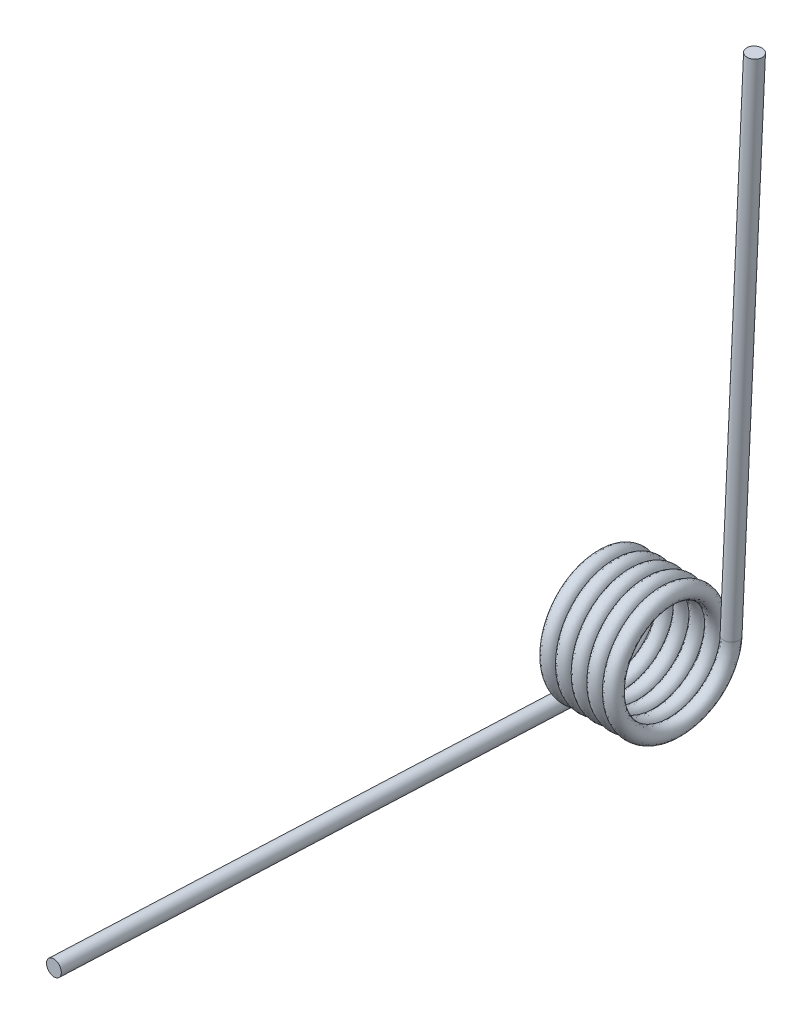
ISO-10303-21;
HEADER;
FILE_DESCRIPTION(('STEP AP214'),'2;1');
FILE_NAME('part.step','',(''),(''),'','','');
FILE_SCHEMA(('AUTOMOTIVE_DESIGN { 1 0 10303 214 1 1 1 1 }'));
ENDSEC;
DATA;
#1=APPLICATION_CONTEXT('core data for automotive mechanical design processes');
#2=APPLICATION_PROTOCOL_DEFINITION('international standard','automotive_design',2000,#1);
#3=PRODUCT_CONTEXT('',#1,'mechanical');
#4=PRODUCT('Part','Part','',(#3));
#5=PRODUCT_RELATED_PRODUCT_CATEGORY('part','',(#4));
#6=PRODUCT_DEFINITION_FORMATION('','',#4);
#7=PRODUCT_DEFINITION_CONTEXT('part definition',#1,'design');
#8=PRODUCT_DEFINITION('design','',#6,#7);
#9=PRODUCT_DEFINITION_SHAPE('','',#8);
#10=(LENGTH_UNIT() NAMED_UNIT(*) SI_UNIT(.MILLI.,.METRE.));
#11=(NAMED_UNIT(*) PLANE_ANGLE_UNIT() SI_UNIT($,.RADIAN.));
#12=(NAMED_UNIT(*) SI_UNIT($,.STERADIAN.) SOLID_ANGLE_UNIT());
#13=UNCERTAINTY_MEASURE_WITH_UNIT(LENGTH_MEASURE(1.E-05),#10,'distance_accuracy_value','');
#14=(GEOMETRIC_REPRESENTATION_CONTEXT(3) GLOBAL_UNCERTAINTY_ASSIGNED_CONTEXT((#13)) GLOBAL_UNIT_ASSIGNED_CONTEXT((#10,
#11,#12)) REPRESENTATION_CONTEXT('',''));
#15=CARTESIAN_POINT('',(0.,0.,0.));
#16=DIRECTION('',(0.,0.,1.));
#17=DIRECTION('',(1.,0.,0.));
#18=AXIS2_PLACEMENT_3D('',#15,#16,#17);
#19=CARTESIAN_POINT('',(-1.33212713981838,-9.43610000000001,-0.0604940770597761));
#20=CARTESIAN_POINT('',(-1.10776047315171,-9.40117372832516,-5.50842895216001));
#21=CARTESIAN_POINT('',(-0.883393806485048,-4.66566059248774,-8.20214935118023));
#22=CARTESIAN_POINT('',(-0.659027139818381,0.0698525433496787,-10.8958697502005));
#23=CARTESIAN_POINT('',(-0.434660473151715,4.77043940751226,-8.14165527412046));
#24=CARTESIAN_POINT('',(-0.210293806485049,9.47102627167484,-5.38744079804046));
#25=CARTESIAN_POINT('',(0.0140728601816173,9.43610000000001,0.0604940770597749));
#26=CARTESIAN_POINT('',(0.238439526848283,9.40117372832517,5.50842895216));
#27=CARTESIAN_POINT('',(0.46280619351495,4.66566059248775,8.20214935118023));
#28=CARTESIAN_POINT('',(0.687172860181616,-0.0698525433496773,10.8958697502005));
#29=CARTESIAN_POINT('',(0.911539526848282,-4.77043940751226,8.14165527412046));
#30=CARTESIAN_POINT('',(1.13590619351495,-9.47102627167484,5.38744079804046));
#31=CARTESIAN_POINT('',(1.36027286018161,-9.43610000000001,-0.0604940770597761));
#32=CARTESIAN_POINT('',(1.58463952684828,-9.40117372832516,-5.50842895216001));
#33=CARTESIAN_POINT('',(1.80900619351495,-4.66566059248774,-8.20214935118023));
#34=CARTESIAN_POINT('',(2.03337286018161,0.0698525433496787,-10.8958697502005));
#35=CARTESIAN_POINT('',(2.25773952684828,4.77043940751226,-8.14165527412046));
#36=CARTESIAN_POINT('',(2.48210619351495,9.47102627167484,-5.38744079804046));
#37=CARTESIAN_POINT('',(2.70647286018161,9.43610000000001,0.0604940770597749));
#38=CARTESIAN_POINT('',(2.93083952684828,9.40117372832517,5.50842895216));
#39=CARTESIAN_POINT('',(3.15520619351494,4.66566059248775,8.20214935118023));
#40=CARTESIAN_POINT('',(3.37957286018161,-0.0698525433496773,10.8958697502005));
#41=CARTESIAN_POINT('',(3.60393952684828,-4.77043940751226,8.14165527412046));
#42=CARTESIAN_POINT('',(3.82830619351494,-9.47102627167484,5.38744079804046));
#43=CARTESIAN_POINT('',(4.05267286018161,-9.43610000000001,-0.0604940770597761));
#44=CARTESIAN_POINT('',(4.27703952684827,-9.40117372832516,-5.50842895216001));
#45=CARTESIAN_POINT('',(4.50140619351494,-4.66566059248774,-8.20214935118023));
#46=CARTESIAN_POINT('',(4.72577286018161,0.0698525433496787,-10.8958697502005));
#47=CARTESIAN_POINT('',(4.95013952684827,4.77043940751226,-8.14165527412046));
#48=CARTESIAN_POINT('',(5.17450619351494,9.47102627167484,-5.38744079804046));
#49=CARTESIAN_POINT('',(5.39887286018161,9.43610000000001,0.0604940770597749));
#50=CARTESIAN_POINT('',(5.62323952684827,9.40117372832517,5.50842895216));
#51=CARTESIAN_POINT('',(5.84760619351494,4.66566059248775,8.20214935118023));
#52=CARTESIAN_POINT('',(6.0719728601816,-0.0698525433496773,10.8958697502005));
#53=CARTESIAN_POINT('',(6.29633952684827,-4.77043940751226,8.14165527412046));
#54=CARTESIAN_POINT('',(6.52070619351494,-9.47102627167484,5.38744079804046));
#55=CARTESIAN_POINT('',(6.7450728601816,-9.43610000000001,-0.0604940770597761));
#56=CARTESIAN_POINT('',(6.96943952684827,-9.40117372832516,-5.50842895216001));
#57=CARTESIAN_POINT('',(7.19380619351493,-4.66566059248774,-8.20214935118023));
#58=CARTESIAN_POINT('',(7.4181728601816,0.0698525433496787,-10.8958697502005));
#59=CARTESIAN_POINT('',(7.64253952684827,4.77043940751226,-8.14165527412046));
#60=CARTESIAN_POINT('',(7.86690619351493,9.47102627167484,-5.38744079804046));
#61=CARTESIAN_POINT('',(8.0912728601816,9.43610000000001,0.0604940770597749));
#62=CARTESIAN_POINT('',(8.31563952684827,9.40117372832517,5.50842895216));
#63=CARTESIAN_POINT('',(8.54000619351493,4.66566059248775,8.20214935118023));
#64=CARTESIAN_POINT('',(8.7643728601816,-0.0698525433496773,10.8958697502005));
#65=CARTESIAN_POINT('',(8.98873952684826,-4.77043940751226,8.14165527412046));
#66=CARTESIAN_POINT('',(9.21310619351493,-9.47102627167484,5.38744079804046));
#67=CARTESIAN_POINT('',(9.4374728601816,-9.43610000000001,-0.0604940770597761));
#68=CARTESIAN_POINT('',(9.66183952684827,-9.40117372832516,-5.50842895216001));
#69=CARTESIAN_POINT('',(9.88620619351493,-4.66566059248774,-8.20214935118023));
#70=CARTESIAN_POINT('',(10.1105728601816,0.0698525433496787,-10.8958697502005));
#71=CARTESIAN_POINT('',(10.3349395268483,4.77043940751226,-8.14165527412046));
#72=CARTESIAN_POINT('',(10.5593061935149,9.47102627167484,-5.38744079804046));
#73=CARTESIAN_POINT('',(10.7836728601816,9.43610000000001,0.0604940770597749));
#74=CARTESIAN_POINT('',(11.0080395268483,9.40117372832517,5.50842895216));
#75=CARTESIAN_POINT('',(11.2324061935149,4.66566059248775,8.20214935118023));
#76=CARTESIAN_POINT('',(11.4567728601816,-0.0698525433496773,10.8958697502005));
#77=CARTESIAN_POINT('',(11.6811395268483,-4.77043940751226,8.14165527412046));
#78=CARTESIAN_POINT('',(11.9055061935149,-9.47102627167484,5.38744079804046));
#79=CARTESIAN_POINT('',(12.1298728601816,-9.43610000000001,-0.0604940770597761));
#80=CARTESIAN_POINT('',(12.3542395268483,-9.40117372832516,-5.50842895216001));
#81=CARTESIAN_POINT('',(12.5786061935149,-4.66566059248774,-8.20214935118023));
#82=CARTESIAN_POINT('',(12.8029728601816,0.0698525433496787,-10.8958697502005));
#83=CARTESIAN_POINT('',(13.0273395268483,4.77043940751226,-8.14165527412046));
#84=CARTESIAN_POINT('',(13.2517061935149,9.47102627167484,-5.38744079804046));
#85=CARTESIAN_POINT('',(13.4760728601816,9.43610000000001,0.0604940770597749));
#86=CARTESIAN_POINT('',(13.7004395268483,9.40117372832517,5.50842895216));
#87=CARTESIAN_POINT('',(13.9248061935149,4.66566059248775,8.20214935118023));
#88=CARTESIAN_POINT('',(14.1491728601816,-0.0698525433496773,10.8958697502005));
#89=CARTESIAN_POINT('',(14.3735395268483,-4.77043940751226,8.14165527412046));
#90=CARTESIAN_POINT('',(14.5979061935149,-9.47102627167484,5.38744079804046));
#91=CARTESIAN_POINT('',(14.8222728601816,-9.43610000000001,-0.0604940770597761));
#92=CARTESIAN_POINT('',(-1.33212713981838,-6.76910000000001,-0.060494077059746));
#93=CARTESIAN_POINT('',(-1.10776047315171,-6.73417372832518,-3.96863578423124));
#94=CARTESIAN_POINT('',(-0.883393806485049,-3.33216059248777,-5.89245959928712));
#95=CARTESIAN_POINT('',(-0.659027139818383,0.0698525433496441,-7.816283414343));
#96=CARTESIAN_POINT('',(-0.434660473151716,3.43693940751224,-5.83196552222738));
#97=CARTESIAN_POINT('',(-0.21029380648505,6.80402627167483,-3.84764763011176));
#98=CARTESIAN_POINT('',(0.014072860181616,6.76910000000001,0.0604940770597451));
#99=CARTESIAN_POINT('',(0.238439526848282,6.73417372832518,3.96863578423124));
#100=CARTESIAN_POINT('',(0.462806193514948,3.33216059248777,5.89245959928712));
#101=CARTESIAN_POINT('',(0.687172860181614,-0.0698525433496432,7.816283414343));
#102=CARTESIAN_POINT('',(0.911539526848281,-3.43693940751223,5.83196552222738));
#103=CARTESIAN_POINT('',(1.13590619351495,-6.80402627167483,3.84764763011176));
#104=CARTESIAN_POINT('',(1.36027286018161,-6.76910000000001,-0.060494077059746));
#105=CARTESIAN_POINT('',(1.58463952684828,-6.73417372832518,-3.96863578423124));
#106=CARTESIAN_POINT('',(1.80900619351495,-3.33216059248777,-5.89245959928712));
#107=CARTESIAN_POINT('',(2.03337286018161,0.0698525433496441,-7.816283414343));
#108=CARTESIAN_POINT('',(2.25773952684828,3.43693940751224,-5.83196552222738));
#109=CARTESIAN_POINT('',(2.48210619351494,6.80402627167483,-3.84764763011176));
#110=CARTESIAN_POINT('',(2.70647286018161,6.76910000000001,0.0604940770597451));
#111=CARTESIAN_POINT('',(2.93083952684828,6.73417372832518,3.96863578423124));
#112=CARTESIAN_POINT('',(3.15520619351494,3.33216059248777,5.89245959928712));
#113=CARTESIAN_POINT('',(3.37957286018161,-0.0698525433496432,7.816283414343));
#114=CARTESIAN_POINT('',(3.60393952684827,-3.43693940751223,5.83196552222738));
#115=CARTESIAN_POINT('',(3.82830619351494,-6.80402627167483,3.84764763011176));
#116=CARTESIAN_POINT('',(4.05267286018161,-6.76910000000001,-0.060494077059746));
#117=CARTESIAN_POINT('',(4.27703952684827,-6.73417372832518,-3.96863578423124));
#118=CARTESIAN_POINT('',(4.50140619351494,-3.33216059248777,-5.89245959928712));
#119=CARTESIAN_POINT('',(4.72577286018161,0.0698525433496441,-7.816283414343));
#120=CARTESIAN_POINT('',(4.95013952684827,3.43693940751224,-5.83196552222738));
#121=CARTESIAN_POINT('',(5.17450619351494,6.80402627167483,-3.84764763011176));
#122=CARTESIAN_POINT('',(5.3988728601816,6.76910000000001,0.0604940770597451));
#123=CARTESIAN_POINT('',(5.62323952684827,6.73417372832518,3.96863578423124));
#124=CARTESIAN_POINT('',(5.84760619351494,3.33216059248777,5.89245959928712));
#125=CARTESIAN_POINT('',(6.0719728601816,-0.0698525433496432,7.816283414343));
#126=CARTESIAN_POINT('',(6.29633952684827,-3.43693940751223,5.83196552222738));
#127=CARTESIAN_POINT('',(6.52070619351494,-6.80402627167483,3.84764763011176));
#128=CARTESIAN_POINT('',(6.7450728601816,-6.76910000000001,-0.060494077059746));
#129=CARTESIAN_POINT('',(6.96943952684827,-6.73417372832518,-3.96863578423124));
#130=CARTESIAN_POINT('',(7.19380619351493,-3.33216059248777,-5.89245959928712));
#131=CARTESIAN_POINT('',(7.4181728601816,0.0698525433496441,-7.816283414343));
#132=CARTESIAN_POINT('',(7.64253952684826,3.43693940751224,-5.83196552222738));
#133=CARTESIAN_POINT('',(7.86690619351493,6.80402627167483,-3.84764763011176));
#134=CARTESIAN_POINT('',(8.0912728601816,6.76910000000001,0.0604940770597451));
#135=CARTESIAN_POINT('',(8.31563952684826,6.73417372832518,3.96863578423124));
#136=CARTESIAN_POINT('',(8.54000619351493,3.33216059248777,5.89245959928712));
#137=CARTESIAN_POINT('',(8.7643728601816,-0.0698525433496432,7.816283414343));
#138=CARTESIAN_POINT('',(8.98873952684826,-3.43693940751223,5.83196552222738));
#139=CARTESIAN_POINT('',(9.21310619351493,-6.80402627167483,3.84764763011176));
#140=CARTESIAN_POINT('',(9.43747286018159,-6.76910000000001,-0.060494077059746));
#141=CARTESIAN_POINT('',(9.66183952684826,-6.73417372832518,-3.96863578423124));
#142=CARTESIAN_POINT('',(9.88620619351493,-3.33216059248777,-5.89245959928712));
#143=CARTESIAN_POINT('',(10.1105728601816,0.0698525433496441,-7.816283414343));
#144=CARTESIAN_POINT('',(10.3349395268483,3.43693940751224,-5.83196552222738));
#145=CARTESIAN_POINT('',(10.5593061935149,6.80402627167483,-3.84764763011176));
#146=CARTESIAN_POINT('',(10.7836728601816,6.76910000000001,0.0604940770597451));
#147=CARTESIAN_POINT('',(11.0080395268483,6.73417372832518,3.96863578423124));
#148=CARTESIAN_POINT('',(11.2324061935149,3.33216059248777,5.89245959928712));
#149=CARTESIAN_POINT('',(11.4567728601816,-0.0698525433496432,7.816283414343));
#150=CARTESIAN_POINT('',(11.6811395268483,-3.43693940751223,5.83196552222738));
#151=CARTESIAN_POINT('',(11.9055061935149,-6.80402627167483,3.84764763011176));
#152=CARTESIAN_POINT('',(12.1298728601816,-6.76910000000001,-0.060494077059746));
#153=CARTESIAN_POINT('',(12.3542395268483,-6.73417372832518,-3.96863578423124));
#154=CARTESIAN_POINT('',(12.5786061935149,-3.33216059248777,-5.89245959928712));
#155=CARTESIAN_POINT('',(12.8029728601816,0.0698525433496441,-7.816283414343));
#156=CARTESIAN_POINT('',(13.0273395268483,3.43693940751224,-5.83196552222738));
#157=CARTESIAN_POINT('',(13.2517061935149,6.80402627167483,-3.84764763011176));
#158=CARTESIAN_POINT('',(13.4760728601816,6.76910000000001,0.0604940770597451));
#159=CARTESIAN_POINT('',(13.7004395268483,6.73417372832518,3.96863578423124));
#160=CARTESIAN_POINT('',(13.9248061935149,3.33216059248777,5.89245959928712));
#161=CARTESIAN_POINT('',(14.1491728601816,-0.0698525433496432,7.816283414343));
#162=CARTESIAN_POINT('',(14.3735395268483,-3.43693940751223,5.83196552222738));
#163=CARTESIAN_POINT('',(14.5979061935149,-6.80402627167483,3.84764763011176));
#164=CARTESIAN_POINT('',(14.8222728601816,-6.76910000000001,-0.060494077059746));
#165=CARTESIAN_POINT('',(1.33212713981838,-6.76910000000001,0.0604940770596085));
#166=CARTESIAN_POINT('',(1.55649380648504,-6.80402627167475,-3.84764763011189));
#167=CARTESIAN_POINT('',(1.78086047315171,-3.43693940751212,-5.83196552222744));
#168=CARTESIAN_POINT('',(2.00522713981838,-0.0698525433494863,-7.816283414343));
#169=CARTESIAN_POINT('',(2.22959380648504,3.33216059248789,-5.89245959928705));
#170=CARTESIAN_POINT('',(2.45396047315171,6.73417372832526,-3.96863578423111));
#171=CARTESIAN_POINT('',(2.67832713981838,6.76910000000001,-0.0604940770596093));
#172=CARTESIAN_POINT('',(2.90269380648504,6.80402627167475,3.84764763011189));
#173=CARTESIAN_POINT('',(3.12706047315171,3.43693940751212,5.83196552222744));
#174=CARTESIAN_POINT('',(3.35142713981837,0.0698525433494872,7.816283414343));
#175=CARTESIAN_POINT('',(3.57579380648504,-3.33216059248788,5.89245959928706));
#176=CARTESIAN_POINT('',(3.80016047315171,-6.73417372832526,3.96863578423111));
#177=CARTESIAN_POINT('',(4.02452713981837,-6.76910000000001,0.0604940770596085));
#178=CARTESIAN_POINT('',(4.24889380648504,-6.80402627167475,-3.84764763011189));
#179=CARTESIAN_POINT('',(4.4732604731517,-3.43693940751212,-5.83196552222744));
#180=CARTESIAN_POINT('',(4.69762713981837,-0.0698525433494863,-7.816283414343));
#181=CARTESIAN_POINT('',(4.92199380648504,3.33216059248789,-5.89245959928705));
#182=CARTESIAN_POINT('',(5.1463604731517,6.73417372832526,-3.96863578423111));
#183=CARTESIAN_POINT('',(5.37072713981837,6.76910000000001,-0.0604940770596093));
#184=CARTESIAN_POINT('',(5.59509380648503,6.80402627167475,3.84764763011189));
#185=CARTESIAN_POINT('',(5.8194604731517,3.43693940751212,5.83196552222744));
#186=CARTESIAN_POINT('',(6.04382713981837,0.0698525433494872,7.816283414343));
#187=CARTESIAN_POINT('',(6.26819380648503,-3.33216059248788,5.89245959928706));
#188=CARTESIAN_POINT('',(6.4925604731517,-6.73417372832526,3.96863578423111));
#189=CARTESIAN_POINT('',(6.71692713981837,-6.76910000000001,0.0604940770596085));
#190=CARTESIAN_POINT('',(6.94129380648503,-6.80402627167475,-3.84764763011189));
#191=CARTESIAN_POINT('',(7.1656604731517,-3.43693940751212,-5.83196552222744));
#192=CARTESIAN_POINT('',(7.39002713981836,-0.0698525433494863,-7.816283414343));
#193=CARTESIAN_POINT('',(7.61439380648503,3.33216059248789,-5.89245959928705));
#194=CARTESIAN_POINT('',(7.8387604731517,6.73417372832526,-3.96863578423111));
#195=CARTESIAN_POINT('',(8.06312713981836,6.76910000000001,-0.0604940770596093));
#196=CARTESIAN_POINT('',(8.28749380648503,6.80402627167475,3.84764763011189));
#197=CARTESIAN_POINT('',(8.51186047315169,3.43693940751212,5.83196552222744));
#198=CARTESIAN_POINT('',(8.73622713981836,0.0698525433494872,7.816283414343));
#199=CARTESIAN_POINT('',(8.96059380648503,-3.33216059248788,5.89245959928706));
#200=CARTESIAN_POINT('',(9.18496047315169,-6.73417372832526,3.96863578423111));
#201=CARTESIAN_POINT('',(9.40932713981836,-6.76910000000001,0.0604940770596085));
#202=CARTESIAN_POINT('',(9.63369380648503,-6.80402627167475,-3.84764763011189));
#203=CARTESIAN_POINT('',(9.85806047315169,-3.43693940751212,-5.83196552222744));
#204=CARTESIAN_POINT('',(10.0824271398184,-0.0698525433494863,-7.816283414343));
#205=CARTESIAN_POINT('',(10.306793806485,3.33216059248789,-5.89245959928705));
#206=CARTESIAN_POINT('',(10.5311604731517,6.73417372832526,-3.96863578423111));
#207=CARTESIAN_POINT('',(10.7555271398184,6.76910000000001,-0.0604940770596093));
#208=CARTESIAN_POINT('',(10.979893806485,6.80402627167475,3.84764763011189));
#209=CARTESIAN_POINT('',(11.2042604731517,3.43693940751212,5.83196552222744));
#210=CARTESIAN_POINT('',(11.4286271398184,0.0698525433494872,7.816283414343));
#211=CARTESIAN_POINT('',(11.652993806485,-3.33216059248788,5.89245959928706));
#212=CARTESIAN_POINT('',(11.8773604731517,-6.73417372832526,3.96863578423111));
#213=CARTESIAN_POINT('',(12.1017271398184,-6.76910000000001,0.0604940770596085));
#214=CARTESIAN_POINT('',(12.326093806485,-6.80402627167475,-3.84764763011189));
#215=CARTESIAN_POINT('',(12.5504604731517,-3.43693940751212,-5.83196552222744));
#216=CARTESIAN_POINT('',(12.7748271398184,-0.0698525433494863,-7.816283414343));
#217=CARTESIAN_POINT('',(12.999193806485,3.33216059248789,-5.89245959928705));
#218=CARTESIAN_POINT('',(13.2235604731517,6.73417372832526,-3.96863578423111));
#219=CARTESIAN_POINT('',(13.4479271398184,6.76910000000001,-0.0604940770596093));
#220=CARTESIAN_POINT('',(13.672293806485,6.80402627167475,3.84764763011189));
#221=CARTESIAN_POINT('',(13.8966604731517,3.43693940751212,5.83196552222744));
#222=CARTESIAN_POINT('',(14.1210271398184,0.0698525433494872,7.816283414343));
#223=CARTESIAN_POINT('',(14.345393806485,-3.33216059248788,5.89245959928706));
#224=CARTESIAN_POINT('',(14.5697604731517,-6.73417372832526,3.96863578423111));
#225=CARTESIAN_POINT('',(14.7941271398184,-6.76910000000001,0.0604940770596085));
#226=CARTESIAN_POINT('',(15.018493806485,-6.80402627167475,-3.84764763011189));
#227=CARTESIAN_POINT('',(15.2428604731517,-3.43693940751212,-5.83196552222744));
#228=CARTESIAN_POINT('',(15.4672271398183,-0.0698525433494863,-7.816283414343));
#229=CARTESIAN_POINT('',(15.691593806485,3.33216059248789,-5.89245959928705));
#230=CARTESIAN_POINT('',(15.9159604731517,6.73417372832526,-3.96863578423111));
#231=CARTESIAN_POINT('',(16.1403271398183,6.76910000000001,-0.0604940770596093));
#232=CARTESIAN_POINT('',(16.364693806485,6.80402627167475,3.84764763011189));
#233=CARTESIAN_POINT('',(16.5890604731517,3.43693940751212,5.83196552222744));
#234=CARTESIAN_POINT('',(16.8134271398183,0.0698525433494872,7.816283414343));
#235=CARTESIAN_POINT('',(17.037793806485,-3.33216059248788,5.89245959928706));
#236=CARTESIAN_POINT('',(17.2621604731517,-6.73417372832526,3.96863578423111));
#237=CARTESIAN_POINT('',(17.4865271398183,-6.76910000000001,0.0604940770596085));
#238=CARTESIAN_POINT('',(1.33212713981838,-9.43610000000001,0.0604940770595784));
#239=CARTESIAN_POINT('',(1.55649380648505,-9.47102627167473,-5.38744079804065));
#240=CARTESIAN_POINT('',(1.78086047315171,-4.77043940751209,-8.14165527412056));
#241=CARTESIAN_POINT('',(2.00522713981838,-0.0698525433494517,-10.8958697502005));
#242=CARTESIAN_POINT('',(2.22959380648504,4.66566059248791,-8.20214935118014));
#243=CARTESIAN_POINT('',(2.45396047315171,9.40117372832528,-5.50842895215981));
#244=CARTESIAN_POINT('',(2.67832713981838,9.43610000000001,-0.0604940770595795));
#245=CARTESIAN_POINT('',(2.90269380648504,9.47102627167473,5.38744079804065));
#246=CARTESIAN_POINT('',(3.12706047315171,4.77043940751209,8.14165527412055));
#247=CARTESIAN_POINT('',(3.35142713981838,0.0698525433494531,10.8958697502005));
#248=CARTESIAN_POINT('',(3.57579380648504,-4.66566059248791,8.20214935118014));
#249=CARTESIAN_POINT('',(3.80016047315171,-9.40117372832528,5.50842895215981));
#250=CARTESIAN_POINT('',(4.02452713981837,-9.43610000000001,0.0604940770595784));
#251=CARTESIAN_POINT('',(4.24889380648504,-9.47102627167473,-5.38744079804065));
#252=CARTESIAN_POINT('',(4.47326047315171,-4.77043940751209,-8.14165527412056));
#253=CARTESIAN_POINT('',(4.69762713981837,-0.0698525433494517,-10.8958697502005));
#254=CARTESIAN_POINT('',(4.92199380648504,4.66566059248791,-8.20214935118014));
#255=CARTESIAN_POINT('',(5.1463604731517,9.40117372832528,-5.50842895215981));
#256=CARTESIAN_POINT('',(5.37072713981837,9.43610000000001,-0.0604940770595795));
#257=CARTESIAN_POINT('',(5.59509380648504,9.47102627167473,5.38744079804065));
#258=CARTESIAN_POINT('',(5.8194604731517,4.77043940751209,8.14165527412055));
#259=CARTESIAN_POINT('',(6.04382713981837,0.0698525433494531,10.8958697502005));
#260=CARTESIAN_POINT('',(6.26819380648504,-4.66566059248791,8.20214935118014));
#261=CARTESIAN_POINT('',(6.4925604731517,-9.40117372832528,5.50842895215981));
#262=CARTESIAN_POINT('',(6.71692713981837,-9.43610000000001,0.0604940770595784));
#263=CARTESIAN_POINT('',(6.94129380648503,-9.47102627167473,-5.38744079804065));
#264=CARTESIAN_POINT('',(7.1656604731517,-4.77043940751209,-8.14165527412056));
#265=CARTESIAN_POINT('',(7.39002713981837,-0.0698525433494517,-10.8958697502005));
#266=CARTESIAN_POINT('',(7.61439380648503,4.66566059248791,-8.20214935118014));
#267=CARTESIAN_POINT('',(7.8387604731517,9.40117372832528,-5.50842895215981));
#268=CARTESIAN_POINT('',(8.06312713981836,9.43610000000001,-0.0604940770595795));
#269=CARTESIAN_POINT('',(8.28749380648503,9.47102627167473,5.38744079804065));
#270=CARTESIAN_POINT('',(8.5118604731517,4.77043940751209,8.14165527412055));
#271=CARTESIAN_POINT('',(8.73622713981836,0.0698525433494531,10.8958697502005));
#272=CARTESIAN_POINT('',(8.96059380648503,-4.66566059248791,8.20214935118014));
#273=CARTESIAN_POINT('',(9.1849604731517,-9.40117372832528,5.50842895215981));
#274=CARTESIAN_POINT('',(9.40932713981836,-9.43610000000001,0.0604940770595784));
#275=CARTESIAN_POINT('',(9.63369380648503,-9.47102627167473,-5.38744079804065));
#276=CARTESIAN_POINT('',(9.85806047315169,-4.77043940751209,-8.14165527412056));
#277=CARTESIAN_POINT('',(10.0824271398184,-0.0698525433494517,-10.8958697502005));
#278=CARTESIAN_POINT('',(10.306793806485,4.66566059248791,-8.20214935118014));
#279=CARTESIAN_POINT('',(10.5311604731517,9.40117372832528,-5.50842895215981));
#280=CARTESIAN_POINT('',(10.7555271398184,9.43610000000001,-0.0604940770595795));
#281=CARTESIAN_POINT('',(10.979893806485,9.47102627167473,5.38744079804065));
#282=CARTESIAN_POINT('',(11.2042604731517,4.77043940751209,8.14165527412055));
#283=CARTESIAN_POINT('',(11.4286271398184,0.0698525433494531,10.8958697502005));
#284=CARTESIAN_POINT('',(11.652993806485,-4.66566059248791,8.20214935118014));
#285=CARTESIAN_POINT('',(11.8773604731517,-9.40117372832528,5.50842895215981));
#286=CARTESIAN_POINT('',(12.1017271398184,-9.43610000000001,0.0604940770595784));
#287=CARTESIAN_POINT('',(12.326093806485,-9.47102627167473,-5.38744079804065));
#288=CARTESIAN_POINT('',(12.5504604731517,-4.77043940751209,-8.14165527412056));
#289=CARTESIAN_POINT('',(12.7748271398184,-0.0698525433494517,-10.8958697502005));
#290=CARTESIAN_POINT('',(12.999193806485,4.66566059248791,-8.20214935118014));
#291=CARTESIAN_POINT('',(13.2235604731517,9.40117372832528,-5.50842895215981));
#292=CARTESIAN_POINT('',(13.4479271398184,9.43610000000001,-0.0604940770595795));
#293=CARTESIAN_POINT('',(13.672293806485,9.47102627167473,5.38744079804065));
#294=CARTESIAN_POINT('',(13.8966604731517,4.77043940751209,8.14165527412055));
#295=CARTESIAN_POINT('',(14.1210271398184,0.0698525433494531,10.8958697502005));
#296=CARTESIAN_POINT('',(14.345393806485,-4.66566059248791,8.20214935118014));
#297=CARTESIAN_POINT('',(14.5697604731517,-9.40117372832528,5.50842895215981));
#298=CARTESIAN_POINT('',(14.7941271398184,-9.43610000000001,0.0604940770595784));
#299=CARTESIAN_POINT('',(15.018493806485,-9.47102627167473,-5.38744079804065));
#300=CARTESIAN_POINT('',(15.2428604731517,-4.77043940751209,-8.14165527412056));
#301=CARTESIAN_POINT('',(15.4672271398183,-0.0698525433494517,-10.8958697502005));
#302=CARTESIAN_POINT('',(15.691593806485,4.66566059248791,-8.20214935118014));
#303=CARTESIAN_POINT('',(15.9159604731517,9.40117372832528,-5.50842895215981));
#304=CARTESIAN_POINT('',(16.1403271398183,9.43610000000001,-0.0604940770595795));
#305=CARTESIAN_POINT('',(16.364693806485,9.47102627167473,5.38744079804065));
#306=CARTESIAN_POINT('',(16.5890604731517,4.77043940751209,8.14165527412055));
#307=CARTESIAN_POINT('',(16.8134271398183,0.0698525433494531,10.8958697502005));
#308=CARTESIAN_POINT('',(17.037793806485,-4.66566059248791,8.20214935118014));
#309=CARTESIAN_POINT('',(17.2621604731517,-9.40117372832528,5.50842895215981));
#310=CARTESIAN_POINT('',(17.4865271398183,-9.43610000000001,0.0604940770595784));
#311=CARTESIAN_POINT('',(1.33212713981838,-12.1031,0.0604940770595483));
#312=CARTESIAN_POINT('',(1.55649380648505,-12.1380262716747,-6.92723396596941));
#313=CARTESIAN_POINT('',(1.78086047315171,-6.10393940751207,-10.4513450260137));
#314=CARTESIAN_POINT('',(2.00522713981838,-0.0698525433494172,-13.9754560860579));
#315=CARTESIAN_POINT('',(2.22959380648505,5.99916059248794,-10.5118391030732));
#316=CARTESIAN_POINT('',(2.45396047315171,12.0681737283253,-7.04822212008851));
#317=CARTESIAN_POINT('',(2.67832713981838,12.1031,-0.0604940770595498));
#318=CARTESIAN_POINT('',(2.90269380648504,12.1380262716747,6.92723396596941));
#319=CARTESIAN_POINT('',(3.12706047315171,6.10393940751207,10.4513450260137));
#320=CARTESIAN_POINT('',(3.35142713981838,0.0698525433494189,13.9754560860579));
#321=CARTESIAN_POINT('',(3.57579380648504,-5.99916059248793,10.5118391030732));
#322=CARTESIAN_POINT('',(3.80016047315171,-12.0681737283253,7.04822212008852));
#323=CARTESIAN_POINT('',(4.02452713981838,-12.1031,0.0604940770595483));
#324=CARTESIAN_POINT('',(4.24889380648504,-12.1380262716747,-6.92723396596941));
#325=CARTESIAN_POINT('',(4.47326047315171,-6.10393940751207,-10.4513450260137));
#326=CARTESIAN_POINT('',(4.69762713981837,-0.0698525433494172,-13.9754560860579));
#327=CARTESIAN_POINT('',(4.92199380648504,5.99916059248794,-10.5118391030732));
#328=CARTESIAN_POINT('',(5.14636047315171,12.0681737283253,-7.04822212008851));
#329=CARTESIAN_POINT('',(5.37072713981837,12.1031,-0.0604940770595498));
#330=CARTESIAN_POINT('',(5.59509380648504,12.1380262716747,6.92723396596941));
#331=CARTESIAN_POINT('',(5.8194604731517,6.10393940751207,10.4513450260137));
#332=CARTESIAN_POINT('',(6.04382713981837,0.0698525433494189,13.9754560860579));
#333=CARTESIAN_POINT('',(6.26819380648504,-5.99916059248793,10.5118391030732));
#334=CARTESIAN_POINT('',(6.4925604731517,-12.0681737283253,7.04822212008852));
#335=CARTESIAN_POINT('',(6.71692713981837,-12.1031,0.0604940770595483));
#336=CARTESIAN_POINT('',(6.94129380648504,-12.1380262716747,-6.92723396596941));
#337=CARTESIAN_POINT('',(7.1656604731517,-6.10393940751207,-10.4513450260137));
#338=CARTESIAN_POINT('',(7.39002713981837,-0.0698525433494172,-13.9754560860579));
#339=CARTESIAN_POINT('',(7.61439380648503,5.99916059248794,-10.5118391030732));
#340=CARTESIAN_POINT('',(7.8387604731517,12.0681737283253,-7.04822212008851));
#341=CARTESIAN_POINT('',(8.06312713981837,12.1031,-0.0604940770595498));
#342=CARTESIAN_POINT('',(8.28749380648503,12.1380262716747,6.92723396596941));
#343=CARTESIAN_POINT('',(8.5118604731517,6.10393940751207,10.4513450260137));
#344=CARTESIAN_POINT('',(8.73622713981837,0.0698525433494189,13.9754560860579));
#345=CARTESIAN_POINT('',(8.96059380648503,-5.99916059248793,10.5118391030732));
#346=CARTESIAN_POINT('',(9.1849604731517,-12.0681737283253,7.04822212008852));
#347=CARTESIAN_POINT('',(9.40932713981836,-12.1031,0.0604940770595483));
#348=CARTESIAN_POINT('',(9.63369380648503,-12.1380262716747,-6.92723396596941));
#349=CARTESIAN_POINT('',(9.8580604731517,-6.10393940751207,-10.4513450260137));
#350=CARTESIAN_POINT('',(10.0824271398184,-0.0698525433494172,-13.9754560860579));
#351=CARTESIAN_POINT('',(10.306793806485,5.99916059248794,-10.5118391030732));
#352=CARTESIAN_POINT('',(10.5311604731517,12.0681737283253,-7.04822212008851));
#353=CARTESIAN_POINT('',(10.7555271398184,12.1031,-0.0604940770595498));
#354=CARTESIAN_POINT('',(10.979893806485,12.1380262716747,6.92723396596941));
#355=CARTESIAN_POINT('',(11.2042604731517,6.10393940751207,10.4513450260137));
#356=CARTESIAN_POINT('',(11.4286271398184,0.0698525433494189,13.9754560860579));
#357=CARTESIAN_POINT('',(11.652993806485,-5.99916059248793,10.5118391030732));
#358=CARTESIAN_POINT('',(11.8773604731517,-12.0681737283253,7.04822212008852));
#359=CARTESIAN_POINT('',(12.1017271398184,-12.1031,0.0604940770595483));
#360=CARTESIAN_POINT('',(12.326093806485,-12.1380262716747,-6.92723396596941));
#361=CARTESIAN_POINT('',(12.5504604731517,-6.10393940751207,-10.4513450260137));
#362=CARTESIAN_POINT('',(12.7748271398184,-0.0698525433494172,-13.9754560860579));
#363=CARTESIAN_POINT('',(12.999193806485,5.99916059248794,-10.5118391030732));
#364=CARTESIAN_POINT('',(13.2235604731517,12.0681737283253,-7.04822212008851));
#365=CARTESIAN_POINT('',(13.4479271398184,12.1031,-0.0604940770595498));
#366=CARTESIAN_POINT('',(13.672293806485,12.1380262716747,6.92723396596941));
#367=CARTESIAN_POINT('',(13.8966604731517,6.10393940751207,10.4513450260137));
#368=CARTESIAN_POINT('',(14.1210271398184,0.0698525433494189,13.9754560860579));
#369=CARTESIAN_POINT('',(14.345393806485,-5.99916059248793,10.5118391030732));
#370=CARTESIAN_POINT('',(14.5697604731517,-12.0681737283253,7.04822212008852));
#371=CARTESIAN_POINT('',(14.7941271398184,-12.1031,0.0604940770595483));
#372=CARTESIAN_POINT('',(15.018493806485,-12.1380262716747,-6.92723396596941));
#373=CARTESIAN_POINT('',(15.2428604731517,-6.10393940751207,-10.4513450260137));
#374=CARTESIAN_POINT('',(15.4672271398184,-0.0698525433494172,-13.9754560860579));
#375=CARTESIAN_POINT('',(15.691593806485,5.99916059248794,-10.5118391030732));
#376=CARTESIAN_POINT('',(15.9159604731517,12.0681737283253,-7.04822212008851));
#377=CARTESIAN_POINT('',(16.1403271398183,12.1031,-0.0604940770595498));
#378=CARTESIAN_POINT('',(16.364693806485,12.1380262716747,6.92723396596941));
#379=CARTESIAN_POINT('',(16.5890604731517,6.10393940751207,10.4513450260137));
#380=CARTESIAN_POINT('',(16.8134271398184,0.0698525433494189,13.9754560860579));
#381=CARTESIAN_POINT('',(17.037793806485,-5.99916059248793,10.5118391030732));
#382=CARTESIAN_POINT('',(17.2621604731517,-12.0681737283253,7.04822212008852));
#383=CARTESIAN_POINT('',(17.4865271398183,-12.1031,0.0604940770595483));
#384=CARTESIAN_POINT('',(-1.33212713981838,-12.1031,-0.0604940770598062));
#385=CARTESIAN_POINT('',(-1.10776047315171,-12.0681737283251,-7.04822212008877));
#386=CARTESIAN_POINT('',(-0.883393806485046,-5.99916059248772,-10.5118391030733));
#387=CARTESIAN_POINT('',(-0.65902713981838,0.0698525433497132,-13.9754560860579));
#388=CARTESIAN_POINT('',(-0.434660473151714,6.10393940751229,-10.4513450260135));
#389=CARTESIAN_POINT('',(-0.210293806485048,12.1380262716749,-6.92723396596916));
#390=CARTESIAN_POINT('',(0.0140728601816186,12.1031,0.0604940770598047));
#391=CARTESIAN_POINT('',(0.238439526848285,12.0681737283252,7.04822212008876));
#392=CARTESIAN_POINT('',(0.462806193514951,5.99916059248772,10.5118391030733));
#393=CARTESIAN_POINT('',(0.687172860181617,-0.0698525433497115,13.9754560860579));
#394=CARTESIAN_POINT('',(0.911539526848283,-6.10393940751228,10.4513450260135));
#395=CARTESIAN_POINT('',(1.13590619351495,-12.1380262716749,6.92723396596916));
#396=CARTESIAN_POINT('',(1.36027286018162,-12.1031,-0.0604940770598062));
#397=CARTESIAN_POINT('',(1.58463952684828,-12.0681737283251,-7.04822212008877));
#398=CARTESIAN_POINT('',(1.80900619351495,-5.99916059248772,-10.5118391030733));
#399=CARTESIAN_POINT('',(2.03337286018161,0.0698525433497132,-13.9754560860579));
#400=CARTESIAN_POINT('',(2.25773952684828,6.10393940751229,-10.4513450260135));
#401=CARTESIAN_POINT('',(2.48210619351495,12.1380262716749,-6.92723396596916));
#402=CARTESIAN_POINT('',(2.70647286018161,12.1031,0.0604940770598047));
#403=CARTESIAN_POINT('',(2.93083952684828,12.0681737283252,7.04822212008876));
#404=CARTESIAN_POINT('',(3.15520619351494,5.99916059248772,10.5118391030733));
#405=CARTESIAN_POINT('',(3.37957286018161,-0.0698525433497115,13.9754560860579));
#406=CARTESIAN_POINT('',(3.60393952684828,-6.10393940751228,10.4513450260135));
#407=CARTESIAN_POINT('',(3.82830619351494,-12.1380262716749,6.92723396596916));
#408=CARTESIAN_POINT('',(4.05267286018161,-12.1031,-0.0604940770598062));
#409=CARTESIAN_POINT('',(4.27703952684827,-12.0681737283251,-7.04822212008877));
#410=CARTESIAN_POINT('',(4.50140619351494,-5.99916059248772,-10.5118391030733));
#411=CARTESIAN_POINT('',(4.72577286018161,0.0698525433497132,-13.9754560860579));
#412=CARTESIAN_POINT('',(4.95013952684827,6.10393940751229,-10.4513450260135));
#413=CARTESIAN_POINT('',(5.17450619351494,12.1380262716749,-6.92723396596916));
#414=CARTESIAN_POINT('',(5.39887286018161,12.1031,0.0604940770598047));
#415=CARTESIAN_POINT('',(5.62323952684827,12.0681737283252,7.04822212008876));
#416=CARTESIAN_POINT('',(5.84760619351494,5.99916059248772,10.5118391030733));
#417=CARTESIAN_POINT('',(6.0719728601816,-0.0698525433497115,13.9754560860579));
#418=CARTESIAN_POINT('',(6.29633952684827,-6.10393940751228,10.4513450260135));
#419=CARTESIAN_POINT('',(6.52070619351494,-12.1380262716749,6.92723396596916));
#420=CARTESIAN_POINT('',(6.7450728601816,-12.1031,-0.0604940770598062));
#421=CARTESIAN_POINT('',(6.96943952684827,-12.0681737283251,-7.04822212008877));
#422=CARTESIAN_POINT('',(7.19380619351494,-5.99916059248772,-10.5118391030733));
#423=CARTESIAN_POINT('',(7.4181728601816,0.0698525433497132,-13.9754560860579));
#424=CARTESIAN_POINT('',(7.64253952684827,6.10393940751229,-10.4513450260135));
#425=CARTESIAN_POINT('',(7.86690619351493,12.1380262716749,-6.92723396596916));
#426=CARTESIAN_POINT('',(8.0912728601816,12.1031,0.0604940770598047));
#427=CARTESIAN_POINT('',(8.31563952684827,12.0681737283252,7.04822212008876));
#428=CARTESIAN_POINT('',(8.54000619351493,5.99916059248772,10.5118391030733));
#429=CARTESIAN_POINT('',(8.7643728601816,-0.0698525433497115,13.9754560860579));
#430=CARTESIAN_POINT('',(8.98873952684827,-6.10393940751228,10.4513450260135));
#431=CARTESIAN_POINT('',(9.21310619351493,-12.1380262716749,6.92723396596916));
#432=CARTESIAN_POINT('',(9.4374728601816,-12.1031,-0.0604940770598062));
#433=CARTESIAN_POINT('',(9.66183952684827,-12.0681737283251,-7.04822212008877));
#434=CARTESIAN_POINT('',(9.88620619351493,-5.99916059248772,-10.5118391030733));
#435=CARTESIAN_POINT('',(10.1105728601816,0.0698525433497132,-13.9754560860579));
#436=CARTESIAN_POINT('',(10.3349395268483,6.10393940751229,-10.4513450260135));
#437=CARTESIAN_POINT('',(10.5593061935149,12.1380262716749,-6.92723396596916));
#438=CARTESIAN_POINT('',(10.7836728601816,12.1031,0.0604940770598047));
#439=CARTESIAN_POINT('',(11.0080395268483,12.0681737283252,7.04822212008876));
#440=CARTESIAN_POINT('',(11.2324061935149,5.99916059248772,10.5118391030733));
#441=CARTESIAN_POINT('',(11.4567728601816,-0.0698525433497115,13.9754560860579));
#442=CARTESIAN_POINT('',(11.6811395268483,-6.10393940751228,10.4513450260135));
#443=CARTESIAN_POINT('',(11.9055061935149,-12.1380262716749,6.92723396596916));
#444=CARTESIAN_POINT('',(12.1298728601816,-12.1031,-0.0604940770598062));
#445=CARTESIAN_POINT('',(12.3542395268483,-12.0681737283251,-7.04822212008877));
#446=CARTESIAN_POINT('',(12.5786061935149,-5.99916059248772,-10.5118391030733));
#447=CARTESIAN_POINT('',(12.8029728601816,0.0698525433497132,-13.9754560860579));
#448=CARTESIAN_POINT('',(13.0273395268483,6.10393940751229,-10.4513450260135));
#449=CARTESIAN_POINT('',(13.2517061935149,12.1380262716749,-6.92723396596916));
#450=CARTESIAN_POINT('',(13.4760728601816,12.1031,0.0604940770598047));
#451=CARTESIAN_POINT('',(13.7004395268483,12.0681737283252,7.04822212008876));
#452=CARTESIAN_POINT('',(13.9248061935149,5.99916059248772,10.5118391030733));
#453=CARTESIAN_POINT('',(14.1491728601816,-0.0698525433497115,13.9754560860579));
#454=CARTESIAN_POINT('',(14.3735395268483,-6.10393940751228,10.4513450260135));
#455=CARTESIAN_POINT('',(14.5979061935149,-12.1380262716749,6.92723396596916));
#456=CARTESIAN_POINT('',(14.8222728601816,-12.1031,-0.0604940770598062));
#457=CARTESIAN_POINT('',(-1.33212713981838,-9.43610000000001,-0.0604940770597761));
#458=CARTESIAN_POINT('',(-1.10776047315171,-9.40117372832516,-5.50842895216001));
#459=CARTESIAN_POINT('',(-0.883393806485048,-4.66566059248774,-8.20214935118023));
#460=CARTESIAN_POINT('',(-0.659027139818381,0.0698525433496787,-10.8958697502005));
#461=CARTESIAN_POINT('',(-0.434660473151715,4.77043940751226,-8.14165527412046));
#462=CARTESIAN_POINT('',(-0.210293806485049,9.47102627167484,-5.38744079804046));
#463=CARTESIAN_POINT('',(0.0140728601816173,9.43610000000001,0.0604940770597749));
#464=CARTESIAN_POINT('',(0.238439526848283,9.40117372832517,5.50842895216));
#465=CARTESIAN_POINT('',(0.46280619351495,4.66566059248775,8.20214935118023));
#466=CARTESIAN_POINT('',(0.687172860181616,-0.0698525433496773,10.8958697502005));
#467=CARTESIAN_POINT('',(0.911539526848282,-4.77043940751226,8.14165527412046));
#468=CARTESIAN_POINT('',(1.13590619351495,-9.47102627167484,5.38744079804046));
#469=CARTESIAN_POINT('',(1.36027286018161,-9.43610000000001,-0.0604940770597761));
#470=CARTESIAN_POINT('',(1.58463952684828,-9.40117372832516,-5.50842895216001));
#471=CARTESIAN_POINT('',(1.80900619351495,-4.66566059248774,-8.20214935118023));
#472=CARTESIAN_POINT('',(2.03337286018161,0.0698525433496787,-10.8958697502005));
#473=CARTESIAN_POINT('',(2.25773952684828,4.77043940751226,-8.14165527412046));
#474=CARTESIAN_POINT('',(2.48210619351495,9.47102627167484,-5.38744079804046));
#475=CARTESIAN_POINT('',(2.70647286018161,9.43610000000001,0.0604940770597749));
#476=CARTESIAN_POINT('',(2.93083952684828,9.40117372832517,5.50842895216));
#477=CARTESIAN_POINT('',(3.15520619351494,4.66566059248775,8.20214935118023));
#478=CARTESIAN_POINT('',(3.37957286018161,-0.0698525433496773,10.8958697502005));
#479=CARTESIAN_POINT('',(3.60393952684828,-4.77043940751226,8.14165527412046));
#480=CARTESIAN_POINT('',(3.82830619351494,-9.47102627167484,5.38744079804046));
#481=CARTESIAN_POINT('',(4.05267286018161,-9.43610000000001,-0.0604940770597761));
#482=CARTESIAN_POINT('',(4.27703952684827,-9.40117372832516,-5.50842895216001));
#483=CARTESIAN_POINT('',(4.50140619351494,-4.66566059248774,-8.20214935118023));
#484=CARTESIAN_POINT('',(4.72577286018161,0.0698525433496787,-10.8958697502005));
#485=CARTESIAN_POINT('',(4.95013952684827,4.77043940751226,-8.14165527412046));
#486=CARTESIAN_POINT('',(5.17450619351494,9.47102627167484,-5.38744079804046));
#487=CARTESIAN_POINT('',(5.39887286018161,9.43610000000001,0.0604940770597749));
#488=CARTESIAN_POINT('',(5.62323952684827,9.40117372832517,5.50842895216));
#489=CARTESIAN_POINT('',(5.84760619351494,4.66566059248775,8.20214935118023));
#490=CARTESIAN_POINT('',(6.0719728601816,-0.0698525433496773,10.8958697502005));
#491=CARTESIAN_POINT('',(6.29633952684827,-4.77043940751226,8.14165527412046));
#492=CARTESIAN_POINT('',(6.52070619351494,-9.47102627167484,5.38744079804046));
#493=CARTESIAN_POINT('',(6.7450728601816,-9.43610000000001,-0.0604940770597761));
#494=CARTESIAN_POINT('',(6.96943952684827,-9.40117372832516,-5.50842895216001));
#495=CARTESIAN_POINT('',(7.19380619351493,-4.66566059248774,-8.20214935118023));
#496=CARTESIAN_POINT('',(7.4181728601816,0.0698525433496787,-10.8958697502005));
#497=CARTESIAN_POINT('',(7.64253952684827,4.77043940751226,-8.14165527412046));
#498=CARTESIAN_POINT('',(7.86690619351493,9.47102627167484,-5.38744079804046));
#499=CARTESIAN_POINT('',(8.0912728601816,9.43610000000001,0.0604940770597749));
#500=CARTESIAN_POINT('',(8.31563952684827,9.40117372832517,5.50842895216));
#501=CARTESIAN_POINT('',(8.54000619351493,4.66566059248775,8.20214935118023));
#502=CARTESIAN_POINT('',(8.7643728601816,-0.0698525433496773,10.8958697502005));
#503=CARTESIAN_POINT('',(8.98873952684826,-4.77043940751226,8.14165527412046));
#504=CARTESIAN_POINT('',(9.21310619351493,-9.47102627167484,5.38744079804046));
#505=CARTESIAN_POINT('',(9.4374728601816,-9.43610000000001,-0.0604940770597761));
#506=CARTESIAN_POINT('',(9.66183952684827,-9.40117372832516,-5.50842895216001));
#507=CARTESIAN_POINT('',(9.88620619351493,-4.66566059248774,-8.20214935118023));
#508=CARTESIAN_POINT('',(10.1105728601816,0.0698525433496787,-10.8958697502005));
#509=CARTESIAN_POINT('',(10.3349395268483,4.77043940751226,-8.14165527412046));
#510=CARTESIAN_POINT('',(10.5593061935149,9.47102627167484,-5.38744079804046));
#511=CARTESIAN_POINT('',(10.7836728601816,9.43610000000001,0.0604940770597749));
#512=CARTESIAN_POINT('',(11.0080395268483,9.40117372832517,5.50842895216));
#513=CARTESIAN_POINT('',(11.2324061935149,4.66566059248775,8.20214935118023));
#514=CARTESIAN_POINT('',(11.4567728601816,-0.0698525433496773,10.8958697502005));
#515=CARTESIAN_POINT('',(11.6811395268483,-4.77043940751226,8.14165527412046));
#516=CARTESIAN_POINT('',(11.9055061935149,-9.47102627167484,5.38744079804046));
#517=CARTESIAN_POINT('',(12.1298728601816,-9.43610000000001,-0.0604940770597761));
#518=CARTESIAN_POINT('',(12.3542395268483,-9.40117372832516,-5.50842895216001));
#519=CARTESIAN_POINT('',(12.5786061935149,-4.66566059248774,-8.20214935118023));
#520=CARTESIAN_POINT('',(12.8029728601816,0.0698525433496787,-10.8958697502005));
#521=CARTESIAN_POINT('',(13.0273395268483,4.77043940751226,-8.14165527412046));
#522=CARTESIAN_POINT('',(13.2517061935149,9.47102627167484,-5.38744079804046));
#523=CARTESIAN_POINT('',(13.4760728601816,9.43610000000001,0.0604940770597749));
#524=CARTESIAN_POINT('',(13.7004395268483,9.40117372832517,5.50842895216));
#525=CARTESIAN_POINT('',(13.9248061935149,4.66566059248775,8.20214935118023));
#526=CARTESIAN_POINT('',(14.1491728601816,-0.0698525433496773,10.8958697502005));
#527=CARTESIAN_POINT('',(14.3735395268483,-4.77043940751226,8.14165527412046));
#528=CARTESIAN_POINT('',(14.5979061935149,-9.47102627167484,5.38744079804046));
#529=CARTESIAN_POINT('',(14.8222728601816,-9.43610000000001,-0.0604940770597761));
#530=(BOUNDED_SURFACE() B_SPLINE_SURFACE(3,2,((#19,#20,#21,#22,#23,#24,#25,#26,#27,#28,#29,#30,
#31,#32,#33,#34,#35,#36,#37,#38,#39,#40,#41,#42,#43,#44,#45,#46,#47,#48,#49,#50,#51,#52,#53,#54,
#55,#56,#57,#58,#59,#60,#61,#62,#63,#64,#65,#66,#67,#68,#69,#70,#71,#72,#73,#74,#75,#76,#77,#78,
#79,#80,#81,#82,#83,#84,#85,#86,#87,#88,#89,#90,#91),(#92,#93,#94,#95,#96,#97,#98,#99,#100,#101,
#102,#103,#104,#105,#106,#107,#108,#109,#110,#111,#112,#113,#114,#115,#116,#117,#118,#119,#120,
#121,#122,#123,#124,#125,#126,#127,#128,#129,#130,#131,#132,#133,#134,#135,#136,#137,#138,#139,
#140,#141,#142,#143,#144,#145,#146,#147,#148,#149,#150,#151,#152,#153,#154,#155,#156,#157,#158,
#159,#160,#161,#162,#163,#164),(#165,#166,#167,#168,#169,#170,#171,#172,#173,#174,#175,#176,
#177,#178,#179,#180,#181,#182,#183,#184,#185,#186,#187,#188,#189,#190,#191,#192,#193,#194,#195,
#196,#197,#198,#199,#200,#201,#202,#203,#204,#205,#206,#207,#208,#209,#210,#211,#212,#213,#214,
#215,#216,#217,#218,#219,#220,#221,#222,#223,#224,#225,#226,#227,#228,#229,#230,#231,#232,#233,
#234,#235,#236,#237),(#238,#239,#240,#241,#242,#243,#244,#245,#246,#247,#248,#249,#250,#251,
#252,#253,#254,#255,#256,#257,#258,#259,#260,#261,#262,#263,#264,#265,#266,#267,#268,#269,#270,
#271,#272,#273,#274,#275,#276,#277,#278,#279,#280,#281,#282,#283,#284,#285,#286,#287,#288,#289,
#290,#291,#292,#293,#294,#295,#296,#297,#298,#299,#300,#301,#302,#303,#304,#305,#306,#307,#308,
#309,#310),(#311,#312,#313,#314,#315,#316,#317,#318,#319,#320,#321,#322,#323,#324,#325,#326,
#327,#328,#329,#330,#331,#332,#333,#334,#335,#336,#337,#338,#339,#340,#341,#342,#343,#344,#345,
#346,#347,#348,#349,#350,#351,#352,#353,#354,#355,#356,#357,#358,#359,#360,#361,#362,#363,#364,
#365,#366,#367,#368,#369,#370,#371,#372,#373,#374,#375,#376,#377,#378,#379,#380,#381,#382,#383),
(#384,#385,#386,#387,#388,#389,#390,#391,#392,#393,#394,#395,#396,#397,#398,#399,#400,#401,#402,
#403,#404,#405,#406,#407,#408,#409,#410,#411,#412,#413,#414,#415,#416,#417,#418,#419,#420,#421,
#422,#423,#424,#425,#426,#427,#428,#429,#430,#431,#432,#433,#434,#435,#436,#437,#438,#439,#440,
#441,#442,#443,#444,#445,#446,#447,#448,#449,#450,#451,#452,#453,#454,#455,#456),(#457,#458,
#459,#460,#461,#462,#463,#464,#465,#466,#467,#468,#469,#470,#471,#472,#473,#474,#475,#476,#477,
#478,#479,#480,#481,#482,#483,#484,#485,#486,#487,#488,#489,#490,#491,#492,#493,#494,#495,#496,
#497,#498,#499,#500,#501,#502,#503,#504,#505,#506,#507,#508,#509,#510,#511,#512,#513,#514,#515,
#516,#517,#518,#519,#520,#521,#522,#523,#524,#525,#526,#527,#528,#529)),.UNSPECIFIED.,.T.,.F.,
.F.) B_SPLINE_SURFACE_WITH_KNOTS((4,3,4),(3,2,2,2,2,2,2,2,2,2,2,2,2,2,2,2,2,2,2,2,2,2,2,2,2,2,2,
2,2,2,2,2,2,2,2,2,3),(0.,0.5,1.),(0.,0.0277777777777778,0.0555555555555556,0.0833333333333333,
0.111111111111111,0.138888888888889,0.166666666666667,0.194444444444444,0.222222222222222,0.25,
0.277777777777778,0.305555555555556,0.333333333333333,0.361111111111111,0.388888888888889,
0.416666666666667,0.444444444444444,0.472222222222222,0.5,0.527777777777778,0.555555555555556,
0.583333333333333,0.611111111111111,0.638888888888889,0.666666666666667,0.694444444444444,
0.722222222222222,0.75,0.777777777777778,0.805555555555556,0.833333333333333,0.861111111111111,
0.888888888888889,0.916666666666667,0.944444444444444,0.972222222222222,1.),
.UNSPECIFIED.) GEOMETRIC_REPRESENTATION_ITEM() RATIONAL_B_SPLINE_SURFACE(((1.,0.866025403784439,
1.,0.866025403784439,1.,0.866025403784439,1.,0.866025403784439,1.,0.866025403784439,1.,
0.866025403784439,1.,0.866025403784439,1.,0.866025403784439,1.,0.866025403784439,1.,
0.866025403784439,1.,0.866025403784439,1.,0.866025403784439,1.,0.866025403784439,1.,
0.866025403784439,1.,0.866025403784439,1.,0.866025403784439,1.,0.866025403784439,1.,
0.866025403784439,1.,0.866025403784439,1.,0.866025403784439,1.,0.866025403784439,1.,
0.866025403784439,1.,0.866025403784439,1.,0.866025403784439,1.,0.866025403784439,1.,
0.866025403784439,1.,0.866025403784439,1.,0.866025403784439,1.,0.866025403784439,1.,
0.866025403784439,1.,0.866025403784439,1.,0.866025403784439,1.,0.866025403784439,1.,
0.866025403784439,1.,0.866025403784439,1.,0.866025403784439,1.),(0.333333333333333,
0.288675134594813,0.333333333333333,0.288675134594813,0.333333333333333,0.288675134594813,
0.333333333333333,0.288675134594813,0.333333333333333,0.288675134594813,0.333333333333333,
0.288675134594813,0.333333333333333,0.288675134594813,0.333333333333333,0.288675134594813,
0.333333333333333,0.288675134594813,0.333333333333333,0.288675134594813,0.333333333333333,
0.288675134594813,0.333333333333333,0.288675134594813,0.333333333333333,0.288675134594813,
0.333333333333333,0.288675134594813,0.333333333333333,0.288675134594813,0.333333333333333,
0.288675134594813,0.333333333333333,0.288675134594813,0.333333333333333,0.288675134594813,
0.333333333333333,0.288675134594813,0.333333333333333,0.288675134594813,0.333333333333333,
0.288675134594813,0.333333333333333,0.288675134594813,0.333333333333333,0.288675134594813,
0.333333333333333,0.288675134594813,0.333333333333333,0.288675134594813,0.333333333333333,
0.288675134594813,0.333333333333333,0.288675134594813,0.333333333333333,0.288675134594813,
0.333333333333333,0.288675134594813,0.333333333333333,0.288675134594813,0.333333333333333,
0.288675134594813,0.333333333333333,0.288675134594813,0.333333333333333,0.288675134594813,
0.333333333333333,0.288675134594813,0.333333333333333,0.288675134594813,0.333333333333333,
0.288675134594813,0.333333333333333),(0.333333333333333,0.288675134594813,0.333333333333333,
0.288675134594813,0.333333333333333,0.288675134594813,0.333333333333333,0.288675134594813,
0.333333333333333,0.288675134594813,0.333333333333333,0.288675134594813,0.333333333333333,
0.288675134594813,0.333333333333333,0.288675134594813,0.333333333333333,0.288675134594813,
0.333333333333333,0.288675134594813,0.333333333333333,0.288675134594813,0.333333333333333,
0.288675134594813,0.333333333333333,0.288675134594813,0.333333333333333,0.288675134594813,
0.333333333333333,0.288675134594813,0.333333333333333,0.288675134594813,0.333333333333333,
0.288675134594813,0.333333333333333,0.288675134594813,0.333333333333333,0.288675134594813,
0.333333333333333,0.288675134594813,0.333333333333333,0.288675134594813,0.333333333333333,
0.288675134594813,0.333333333333333,0.288675134594813,0.333333333333333,0.288675134594813,
0.333333333333333,0.288675134594813,0.333333333333333,0.288675134594813,0.333333333333333,
0.288675134594813,0.333333333333333,0.288675134594813,0.333333333333333,0.288675134594813,
0.333333333333333,0.288675134594813,0.333333333333333,0.288675134594813,0.333333333333333,
0.288675134594813,0.333333333333333,0.288675134594813,0.333333333333333,0.288675134594813,
0.333333333333333,0.288675134594813,0.333333333333333,0.288675134594813,0.333333333333333),(1.,
0.866025403784439,1.,0.866025403784439,1.,0.866025403784439,1.,0.866025403784439,1.,
0.866025403784439,1.,0.866025403784439,1.,0.866025403784439,1.,0.866025403784439,1.,
0.866025403784439,1.,0.866025403784439,1.,0.866025403784439,1.,0.866025403784439,1.,
0.866025403784439,1.,0.866025403784439,1.,0.866025403784439,1.,0.866025403784439,1.,
0.866025403784439,1.,0.866025403784439,1.,0.866025403784439,1.,0.866025403784439,1.,
0.866025403784439,1.,0.866025403784439,1.,0.866025403784439,1.,0.866025403784439,1.,
0.866025403784439,1.,0.866025403784439,1.,0.866025403784439,1.,0.866025403784439,1.,
0.866025403784439,1.,0.866025403784439,1.,0.866025403784439,1.,0.866025403784439,1.,
0.866025403784439,1.,0.866025403784439,1.,0.866025403784439,1.,0.866025403784439,1.),
(0.333333333333333,0.288675134594813,0.333333333333333,0.288675134594813,0.333333333333333,
0.288675134594813,0.333333333333333,0.288675134594813,0.333333333333333,0.288675134594813,
0.333333333333333,0.288675134594813,0.333333333333333,0.288675134594813,0.333333333333333,
0.288675134594813,0.333333333333333,0.288675134594813,0.333333333333333,0.288675134594813,
0.333333333333333,0.288675134594813,0.333333333333333,0.288675134594813,0.333333333333333,
0.288675134594813,0.333333333333333,0.288675134594813,0.333333333333333,0.288675134594813,
0.333333333333333,0.288675134594813,0.333333333333333,0.288675134594813,0.333333333333333,
0.288675134594813,0.333333333333333,0.288675134594813,0.333333333333333,0.288675134594813,
0.333333333333333,0.288675134594813,0.333333333333333,0.288675134594813,0.333333333333333,
0.288675134594813,0.333333333333333,0.288675134594813,0.333333333333333,0.288675134594813,
0.333333333333333,0.288675134594813,0.333333333333333,0.288675134594813,0.333333333333333,
0.288675134594813,0.333333333333333,0.288675134594813,0.333333333333333,0.288675134594813,
0.333333333333333,0.288675134594813,0.333333333333333,0.288675134594813,0.333333333333333,
0.288675134594813,0.333333333333333,0.288675134594813,0.333333333333333,0.288675134594813,
0.333333333333333,0.288675134594813,0.333333333333333),(0.333333333333333,0.288675134594813,
0.333333333333333,0.288675134594813,0.333333333333333,0.288675134594813,0.333333333333333,
0.288675134594813,0.333333333333333,0.288675134594813,0.333333333333333,0.288675134594813,
0.333333333333333,0.288675134594813,0.333333333333333,0.288675134594813,0.333333333333333,
0.288675134594813,0.333333333333333,0.288675134594813,0.333333333333333,0.288675134594813,
0.333333333333333,0.288675134594813,0.333333333333333,0.288675134594813,0.333333333333333,
0.288675134594813,0.333333333333333,0.288675134594813,0.333333333333333,0.288675134594813,
0.333333333333333,0.288675134594813,0.333333333333333,0.288675134594813,0.333333333333333,
0.288675134594813,0.333333333333333,0.288675134594813,0.333333333333333,0.288675134594813,
0.333333333333333,0.288675134594813,0.333333333333333,0.288675134594813,0.333333333333333,
0.288675134594813,0.333333333333333,0.288675134594813,0.333333333333333,0.288675134594813,
0.333333333333333,0.288675134594813,0.333333333333333,0.288675134594813,0.333333333333333,
0.288675134594813,0.333333333333333,0.288675134594813,0.333333333333333,0.288675134594813,
0.333333333333333,0.288675134594813,0.333333333333333,0.288675134594813,0.333333333333333,
0.288675134594813,0.333333333333333,0.288675134594813,0.333333333333333,0.288675134594813,
0.333333333333333),(1.,0.866025403784439,1.,0.866025403784439,1.,0.866025403784439,1.,
0.866025403784439,1.,0.866025403784439,1.,0.866025403784439,1.,0.866025403784439,1.,
0.866025403784439,1.,0.866025403784439,1.,0.866025403784439,1.,0.866025403784439,1.,
0.866025403784439,1.,0.866025403784439,1.,0.866025403784439,1.,0.866025403784439,1.,
0.866025403784439,1.,0.866025403784439,1.,0.866025403784439,1.,0.866025403784439,1.,
0.866025403784439,1.,0.866025403784439,1.,0.866025403784439,1.,0.866025403784439,1.,
0.866025403784439,1.,0.866025403784439,1.,0.866025403784439,1.,0.866025403784439,1.,
0.866025403784439,1.,0.866025403784439,1.,0.866025403784439,1.,0.866025403784439,1.,
0.866025403784439,1.,0.866025403784439,1.,0.866025403784439,1.,0.866025403784439,1.,
0.866025403784439,1.))) REPRESENTATION_ITEM('') SURFACE());
#531=CARTESIAN_POINT('',(14.1351,7.7394011662342E-13,-9.43610000000001));
#532=DIRECTION('',(0.0453648871838599,0.998970483553341,0.));
#533=DIRECTION('',(-0.998970483553341,0.0453648871838599,0.));
#534=AXIS2_PLACEMENT_3D('',#531,#532,#533);
#535=CIRCLE('',#534,1.3335);
#536=CARTESIAN_POINT('',(12.8029728601816,0.0604940770604512,-9.4361));
#537=VERTEX_POINT('',#536);
#538=EDGE_CURVE('E10',#537,#537,#535,.T.);
#539=CARTESIAN_POINT('',(0.,-9.43610000000001,-1.06688881904363E-13));
#540=DIRECTION('',(-0.0453648871838599,0.,0.998970483553341));
#541=DIRECTION('',(0.998970483553341,0.,0.0453648871838599));
#542=AXIS2_PLACEMENT_3D('',#539,#540,#541);
#543=CIRCLE('',#542,1.3335);
#544=CARTESIAN_POINT('',(1.33212713981838,-9.43610000000001,0.0604940770595705));
#545=VERTEX_POINT('',#544);
#546=EDGE_CURVE('E46',#545,#545,#543,.T.);
#547=ORIENTED_EDGE('',*,*,#538,.F.);
#548=EDGE_LOOP('',(#547));
#549=FACE_BOUND('',#548,.T.);
#550=ORIENTED_EDGE('',*,*,#546,.F.);
#551=EDGE_LOOP('',(#550));
#552=FACE_BOUND('',#551,.T.);
#553=ADVANCED_FACE('F34',(#549,#552),#530,.T.);
#554=CARTESIAN_POINT('',(-4.03293847064515,-9.43610000000101,88.8084759878919));
#555=DIRECTION('',(0.0453648871838599,0.,-0.998970483553341));
#556=DIRECTION('',(-0.998970483553341,0.,-0.0453648871838599));
#557=AXIS2_PLACEMENT_3D('',#554,#555,#556);
#558=CYLINDRICAL_SURFACE('',#557,1.3335);
#559=CARTESIAN_POINT('',(-4.03293847064515,-9.43610000000101,88.8084759878919));
#560=DIRECTION('',(-0.0453648871838599,0.,0.998970483553341));
#561=DIRECTION('',(0.998970483553341,0.,0.0453648871838599));
#562=AXIS2_PLACEMENT_3D('',#559,#560,#561);
#563=CIRCLE('',#562,1.3335);
#564=CARTESIAN_POINT('',(-2.70081133082677,-9.43610000000101,88.8689700649516));
#565=VERTEX_POINT('',#564);
#566=EDGE_CURVE('E42',#565,#565,#563,.T.);
#567=ORIENTED_EDGE('',*,*,#566,.F.);
#568=EDGE_LOOP('',(#567));
#569=FACE_BOUND('',#568,.T.);
#570=ORIENTED_EDGE('',*,*,#546,.T.);
#571=EDGE_LOOP('',(#570));
#572=FACE_BOUND('',#571,.T.);
#573=ADVANCED_FACE('F67',(#569,#572),#558,.T.);
#574=CARTESIAN_POINT('',(-4.03293847064515,-9.43610000000101,88.8084759878919));
#575=DIRECTION('',(-0.0453648871838599,0.,0.998970483553341));
#576=DIRECTION('',(0.998970483553341,0.,0.0453648871838599));
#577=AXIS2_PLACEMENT_3D('',#574,#575,#576);
#578=PLANE('',#577);
#579=ORIENTED_EDGE('',*,*,#566,.T.);
#580=EDGE_LOOP('',(#579));
#581=FACE_BOUND('',#580,.T.);
#582=ADVANCED_FACE('F60',(#581),#578,.T.);
#583=CARTESIAN_POINT('',(18.1680384706451,88.8084759878928,-9.43609999999264));
#584=DIRECTION('',(-0.0453648871838599,-0.998970483553341,0.));
#585=DIRECTION('',(0.998970483553341,-0.0453648871838599,0.));
#586=AXIS2_PLACEMENT_3D('',#583,#584,#585);
#587=CYLINDRICAL_SURFACE('',#586,1.3335);
#588=CARTESIAN_POINT('',(18.1680384706451,88.8084759878928,-9.43609999999264));
#589=DIRECTION('',(0.0453648871838599,0.998970483553341,0.));
#590=DIRECTION('',(-0.998970483553341,0.0453648871838599,0.));
#591=AXIS2_PLACEMENT_3D('',#588,#589,#590);
#592=CIRCLE('',#591,1.3335);
#593=CARTESIAN_POINT('',(16.8359113308268,88.8689700649524,-9.43609999999264));
#594=VERTEX_POINT('',#593);
#595=EDGE_CURVE('E51',#594,#594,#592,.T.);
#596=ORIENTED_EDGE('',*,*,#595,.F.);
#597=EDGE_LOOP('',(#596));
#598=FACE_BOUND('',#597,.T.);
#599=ORIENTED_EDGE('',*,*,#538,.T.);
#600=EDGE_LOOP('',(#599));
#601=FACE_BOUND('',#600,.T.);
#602=ADVANCED_FACE('F58',(#598,#601),#587,.T.);
#603=CARTESIAN_POINT('',(18.1680384706451,88.8084759878928,-9.43609999999264));
#604=DIRECTION('',(0.0453648871838599,0.998970483553341,0.));
#605=DIRECTION('',(-0.998970483553341,0.0453648871838599,0.));
#606=AXIS2_PLACEMENT_3D('',#603,#604,#605);
#607=PLANE('',#606);
#608=ORIENTED_EDGE('',*,*,#595,.T.);
#609=EDGE_LOOP('',(#608));
#610=FACE_BOUND('',#609,.T.);
#611=ADVANCED_FACE('F56',(#610),#607,.T.);
#612=CLOSED_SHELL('',(#553,#573,#582,#602,#611));
#613=MANIFOLD_SOLID_BREP('B2',#612);
#614=ADVANCED_BREP_SHAPE_REPRESENTATION('',(#18,#613),#14);
#615=SHAPE_DEFINITION_REPRESENTATION(#9,#614);
ENDSEC;
END-ISO-10303-21;
